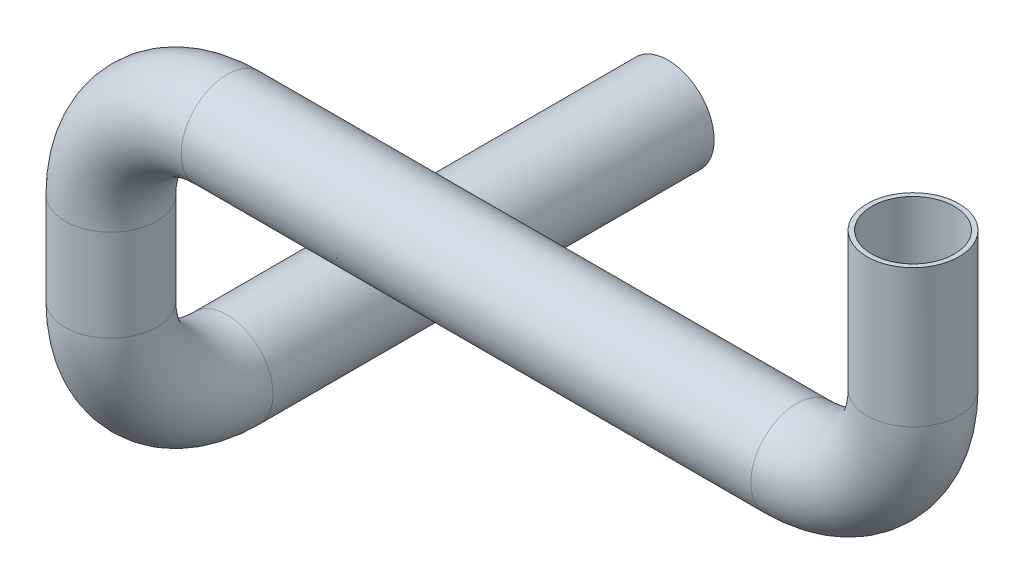
ISO-10303-21;
HEADER;
FILE_DESCRIPTION(('STEP AP214'),'2;1');
FILE_NAME('part.step','',(''),(''),'','','');
FILE_SCHEMA(('AUTOMOTIVE_DESIGN { 1 0 10303 214 1 1 1 1 }'));
ENDSEC;
DATA;
#1=APPLICATION_CONTEXT('core data for automotive mechanical design processes');
#2=APPLICATION_PROTOCOL_DEFINITION('international standard','automotive_design',2000,#1);
#3=PRODUCT_CONTEXT('',#1,'mechanical');
#4=PRODUCT('Part','Part','',(#3));
#5=PRODUCT_RELATED_PRODUCT_CATEGORY('part','',(#4));
#6=PRODUCT_DEFINITION_FORMATION('','',#4);
#7=PRODUCT_DEFINITION_CONTEXT('part definition',#1,'design');
#8=PRODUCT_DEFINITION('design','',#6,#7);
#9=PRODUCT_DEFINITION_SHAPE('','',#8);
#10=(LENGTH_UNIT() NAMED_UNIT(*) SI_UNIT(.MILLI.,.METRE.));
#11=(NAMED_UNIT(*) PLANE_ANGLE_UNIT() SI_UNIT($,.RADIAN.));
#12=(NAMED_UNIT(*) SI_UNIT($,.STERADIAN.) SOLID_ANGLE_UNIT());
#13=UNCERTAINTY_MEASURE_WITH_UNIT(LENGTH_MEASURE(1.E-05),#10,'distance_accuracy_value','');
#14=(GEOMETRIC_REPRESENTATION_CONTEXT(3) GLOBAL_UNCERTAINTY_ASSIGNED_CONTEXT((#13)) GLOBAL_UNIT_ASSIGNED_CONTEXT((#10,
#11,#12)) REPRESENTATION_CONTEXT('',''));
#15=CARTESIAN_POINT('',(0.,0.,0.));
#16=DIRECTION('',(0.,0.,1.));
#17=DIRECTION('',(1.,0.,0.));
#18=AXIS2_PLACEMENT_3D('',#15,#16,#17);
#19=CARTESIAN_POINT('',(-43.65,-12.65,0.));
#20=DIRECTION('',(0.,-1.,0.));
#21=DIRECTION('',(1.,0.,0.));
#22=AXIS2_PLACEMENT_3D('',#19,#20,#21);
#23=CYLINDRICAL_SURFACE('',#22,5.);
#24=CARTESIAN_POINT('',(-43.65,-12.65,0.));
#25=DIRECTION('',(0.,1.,0.));
#26=DIRECTION('',(0.,0.,1.));
#27=AXIS2_PLACEMENT_3D('',#24,#25,#26);
#28=CIRCLE('',#27,5.);
#29=CARTESIAN_POINT('',(-48.65,-12.65,0.));
#30=VERTEX_POINT('',#29);
#31=EDGE_CURVE('E10',#30,#30,#28,.T.);
#32=ORIENTED_EDGE('',*,*,#31,.F.);
#33=EDGE_LOOP('',(#32));
#34=FACE_BOUND('',#33,.T.);
#35=CARTESIAN_POINT('',(-43.65,-22.65,0.));
#36=DIRECTION('',(0.,-1.,0.));
#37=DIRECTION('',(0.,0.,-1.));
#38=AXIS2_PLACEMENT_3D('',#35,#36,#37);
#39=CIRCLE('',#38,5.);
#40=CARTESIAN_POINT('',(-43.65,-22.65,4.99999999999999));
#41=VERTEX_POINT('',#40);
#42=EDGE_CURVE('E59',#41,#41,#39,.T.);
#43=ORIENTED_EDGE('',*,*,#42,.F.);
#44=EDGE_LOOP('',(#43));
#45=FACE_BOUND('',#44,.T.);
#46=ADVANCED_FACE('F31',(#34,#45),#23,.T.);
#47=CARTESIAN_POINT('',(-31.,-12.65,0.));
#48=DIRECTION('',(0.,0.,1.));
#49=DIRECTION('',(1.,0.,0.));
#50=AXIS2_PLACEMENT_3D('',#47,#48,#49);
#51=TOROIDAL_SURFACE('',#50,12.65,5.);
#52=CARTESIAN_POINT('',(-31.,0.,0.));
#53=DIRECTION('',(1.,0.,0.));
#54=DIRECTION('',(0.,0.,1.));
#55=AXIS2_PLACEMENT_3D('',#52,#53,#54);
#56=CIRCLE('',#55,5.);
#57=CARTESIAN_POINT('',(-31.,4.99999999999999,0.));
#58=VERTEX_POINT('',#57);
#59=EDGE_CURVE('E37',#58,#58,#56,.T.);
#60=CARTESIAN_POINT('',(-31.,-12.65,0.));
#61=DIRECTION('',(0.,0.,1.));
#62=DIRECTION('',(1.,0.,0.));
#63=AXIS2_PLACEMENT_3D('',#60,#61,#62);
#64=CIRCLE('',#63,17.65);
#65=EDGE_CURVE('',#58,#30,#64,.T.);
#66=ORIENTED_EDGE('',*,*,#59,.F.);
#67=ORIENTED_EDGE('',*,*,#31,.T.);
#68=ORIENTED_EDGE('',*,*,#65,.T.);
#69=ORIENTED_EDGE('',*,*,#65,.F.);
#70=EDGE_LOOP('',(#66,#68,#67,#69));
#71=FACE_BOUND('',#70,.T.);
#72=ADVANCED_FACE('F105',(#71),#51,.T.);
#73=CARTESIAN_POINT('',(31.,0.,0.));
#74=DIRECTION('',(-1.,0.,0.));
#75=DIRECTION('',(0.,-1.,0.));
#76=AXIS2_PLACEMENT_3D('',#73,#74,#75);
#77=CYLINDRICAL_SURFACE('',#76,5.);
#78=CARTESIAN_POINT('',(31.,0.,0.));
#79=DIRECTION('',(1.,0.,0.));
#80=DIRECTION('',(0.,0.,1.));
#81=AXIS2_PLACEMENT_3D('',#78,#79,#80);
#82=CIRCLE('',#81,5.);
#83=CARTESIAN_POINT('',(31.,-4.99999999999999,0.));
#84=VERTEX_POINT('',#83);
#85=EDGE_CURVE('E41',#84,#84,#82,.T.);
#86=ORIENTED_EDGE('',*,*,#85,.F.);
#87=EDGE_LOOP('',(#86));
#88=FACE_BOUND('',#87,.T.);
#89=ORIENTED_EDGE('',*,*,#59,.T.);
#90=EDGE_LOOP('',(#89));
#91=FACE_BOUND('',#90,.T.);
#92=ADVANCED_FACE('F110',(#88,#91),#77,.T.);
#93=CARTESIAN_POINT('',(31.,12.65,0.));
#94=DIRECTION('',(0.,0.,-1.));
#95=DIRECTION('',(-1.,0.,0.));
#96=AXIS2_PLACEMENT_3D('',#93,#94,#95);
#97=TOROIDAL_SURFACE('',#96,12.65,5.);
#98=CARTESIAN_POINT('',(43.65,12.65,0.));
#99=DIRECTION('',(0.,1.,0.));
#100=DIRECTION('',(0.,0.,1.));
#101=AXIS2_PLACEMENT_3D('',#98,#99,#100);
#102=CIRCLE('',#101,5.);
#103=CARTESIAN_POINT('',(48.65,12.65,0.));
#104=VERTEX_POINT('',#103);
#105=EDGE_CURVE('E45',#104,#104,#102,.T.);
#106=CARTESIAN_POINT('',(31.,12.65,0.));
#107=DIRECTION('',(0.,0.,-1.));
#108=DIRECTION('',(-1.,0.,0.));
#109=AXIS2_PLACEMENT_3D('',#106,#107,#108);
#110=CIRCLE('',#109,17.65);
#111=EDGE_CURVE('',#104,#84,#110,.T.);
#112=ORIENTED_EDGE('',*,*,#105,.F.);
#113=ORIENTED_EDGE('',*,*,#85,.T.);
#114=ORIENTED_EDGE('',*,*,#111,.T.);
#115=ORIENTED_EDGE('',*,*,#111,.F.);
#116=EDGE_LOOP('',(#112,#114,#113,#115));
#117=FACE_BOUND('',#116,.T.);
#118=ADVANCED_FACE('F138',(#117),#97,.T.);
#119=CARTESIAN_POINT('',(43.65,12.65,0.));
#120=DIRECTION('',(0.,1.,0.));
#121=DIRECTION('',(0.,0.,1.));
#122=AXIS2_PLACEMENT_3D('',#119,#120,#121);
#123=CYLINDRICAL_SURFACE('',#122,5.);
#124=ORIENTED_EDGE('',*,*,#105,.T.);
#125=EDGE_LOOP('',(#124));
#126=FACE_BOUND('',#125,.T.);
#127=CARTESIAN_POINT('',(43.65,27.65,0.));
#128=DIRECTION('',(0.,1.,0.));
#129=DIRECTION('',(0.,0.,1.));
#130=AXIS2_PLACEMENT_3D('',#127,#128,#129);
#131=CIRCLE('',#130,5.);
#132=CARTESIAN_POINT('',(43.65,27.65,5.));
#133=VERTEX_POINT('',#132);
#134=EDGE_CURVE('E48',#133,#133,#131,.T.);
#135=ORIENTED_EDGE('',*,*,#134,.F.);
#136=EDGE_LOOP('',(#135));
#137=FACE_BOUND('',#136,.T.);
#138=ADVANCED_FACE('F134',(#126,#137),#123,.T.);
#139=CARTESIAN_POINT('',(43.65,27.65,0.));
#140=DIRECTION('',(0.,1.,0.));
#141=DIRECTION('',(0.,0.,1.));
#142=AXIS2_PLACEMENT_3D('',#139,#140,#141);
#143=PLANE('',#142);
#144=CARTESIAN_POINT('',(43.65,27.65,0.));
#145=DIRECTION('',(0.,1.,0.));
#146=DIRECTION('',(0.,0.,1.));
#147=AXIS2_PLACEMENT_3D('',#144,#145,#146);
#148=CIRCLE('',#147,4.5);
#149=CARTESIAN_POINT('',(43.65,27.65,4.5));
#150=VERTEX_POINT('',#149);
#151=EDGE_CURVE('E66',#150,#150,#148,.T.);
#152=ORIENTED_EDGE('',*,*,#151,.F.);
#153=EDGE_LOOP('',(#152));
#154=FACE_BOUND('',#153,.T.);
#155=ORIENTED_EDGE('',*,*,#134,.T.);
#156=EDGE_LOOP('',(#155));
#157=FACE_BOUND('',#156,.T.);
#158=ADVANCED_FACE('F126',(#154,#157),#143,.T.);
#159=CARTESIAN_POINT('',(-43.65,-35.3,-12.65));
#160=DIRECTION('',(0.,0.,-1.));
#161=DIRECTION('',(-1.,0.,0.));
#162=AXIS2_PLACEMENT_3D('',#159,#160,#161);
#163=CYLINDRICAL_SURFACE('',#162,5.);
#164=CARTESIAN_POINT('',(-43.65,-35.3,-12.65));
#165=DIRECTION('',(0.,0.,-1.));
#166=DIRECTION('',(0.,1.,0.));
#167=AXIS2_PLACEMENT_3D('',#164,#165,#166);
#168=CIRCLE('',#167,5.);
#169=CARTESIAN_POINT('',(-43.65,-40.3,-12.65));
#170=VERTEX_POINT('',#169);
#171=EDGE_CURVE('E56',#170,#170,#168,.T.);
#172=ORIENTED_EDGE('',*,*,#171,.T.);
#173=EDGE_LOOP('',(#172));
#174=FACE_BOUND('',#173,.T.);
#175=CARTESIAN_POINT('',(-43.65,-35.3,-60.65));
#176=DIRECTION('',(0.,0.,-1.));
#177=DIRECTION('',(0.,1.,0.));
#178=AXIS2_PLACEMENT_3D('',#175,#176,#177);
#179=CIRCLE('',#178,5.);
#180=CARTESIAN_POINT('',(-43.65,-30.3,-60.65));
#181=VERTEX_POINT('',#180);
#182=EDGE_CURVE('E51',#181,#181,#179,.T.);
#183=ORIENTED_EDGE('',*,*,#182,.F.);
#184=EDGE_LOOP('',(#183));
#185=FACE_BOUND('',#184,.T.);
#186=ADVANCED_FACE('F117',(#174,#185),#163,.T.);
#187=CARTESIAN_POINT('',(-43.65,-22.65,-12.65));
#188=DIRECTION('',(-1.,0.,0.));
#189=DIRECTION('',(0.,0.,1.));
#190=AXIS2_PLACEMENT_3D('',#187,#188,#189);
#191=TOROIDAL_SURFACE('',#190,12.65,5.);
#192=CARTESIAN_POINT('',(-43.65,-22.65,-12.65));
#193=DIRECTION('',(-1.,0.,0.));
#194=DIRECTION('',(0.,0.,1.));
#195=AXIS2_PLACEMENT_3D('',#192,#193,#194);
#196=CIRCLE('',#195,17.65);
#197=EDGE_CURVE('',#170,#41,#196,.T.);
#198=ORIENTED_EDGE('',*,*,#171,.F.);
#199=ORIENTED_EDGE('',*,*,#42,.T.);
#200=ORIENTED_EDGE('',*,*,#197,.T.);
#201=ORIENTED_EDGE('',*,*,#197,.F.);
#202=EDGE_LOOP('',(#198,#200,#199,#201));
#203=FACE_BOUND('',#202,.T.);
#204=ADVANCED_FACE('F115',(#203),#191,.T.);
#205=CARTESIAN_POINT('',(-43.65,-35.3,-60.65));
#206=DIRECTION('',(0.,0.,-1.));
#207=DIRECTION('',(0.,1.,0.));
#208=AXIS2_PLACEMENT_3D('',#205,#206,#207);
#209=PLANE('',#208);
#210=CARTESIAN_POINT('',(-43.65,-35.3,-60.65));
#211=DIRECTION('',(0.,0.,-1.));
#212=DIRECTION('',(0.,1.,0.));
#213=AXIS2_PLACEMENT_3D('',#210,#211,#212);
#214=CIRCLE('',#213,4.5);
#215=CARTESIAN_POINT('',(-43.65,-30.8,-60.65));
#216=VERTEX_POINT('',#215);
#217=EDGE_CURVE('E63',#216,#216,#214,.T.);
#218=ORIENTED_EDGE('',*,*,#217,.F.);
#219=EDGE_LOOP('',(#218));
#220=FACE_BOUND('',#219,.T.);
#221=ORIENTED_EDGE('',*,*,#182,.T.);
#222=EDGE_LOOP('',(#221));
#223=FACE_BOUND('',#222,.T.);
#224=ADVANCED_FACE('F102',(#220,#223),#209,.T.);
#225=CARTESIAN_POINT('',(-43.65,-12.65,0.));
#226=DIRECTION('',(0.,-1.,0.));
#227=DIRECTION('',(1.,0.,0.));
#228=AXIS2_PLACEMENT_3D('',#225,#226,#227);
#229=CYLINDRICAL_SURFACE('',#228,4.5);
#230=CARTESIAN_POINT('',(-43.65,-12.65,0.));
#231=DIRECTION('',(0.,1.,0.));
#232=DIRECTION('',(-1.,0.,0.));
#233=AXIS2_PLACEMENT_3D('',#230,#231,#232);
#234=CIRCLE('',#233,4.5);
#235=CARTESIAN_POINT('',(-48.15,-12.65,0.));
#236=VERTEX_POINT('',#235);
#237=EDGE_CURVE('E62',#236,#236,#234,.T.);
#238=ORIENTED_EDGE('',*,*,#237,.T.);
#239=EDGE_LOOP('',(#238));
#240=FACE_BOUND('',#239,.T.);
#241=CARTESIAN_POINT('',(-43.65,-22.65,0.));
#242=DIRECTION('',(0.,-1.,0.));
#243=DIRECTION('',(0.,0.,-1.));
#244=AXIS2_PLACEMENT_3D('',#241,#242,#243);
#245=CIRCLE('',#244,4.5);
#246=CARTESIAN_POINT('',(-43.65,-22.65,4.49999999999999));
#247=VERTEX_POINT('',#246);
#248=EDGE_CURVE('E73',#247,#247,#245,.T.);
#249=ORIENTED_EDGE('',*,*,#248,.T.);
#250=EDGE_LOOP('',(#249));
#251=FACE_BOUND('',#250,.T.);
#252=ADVANCED_FACE('F87',(#240,#251),#229,.F.);
#253=CARTESIAN_POINT('',(-31.,-12.65,0.));
#254=DIRECTION('',(0.,0.,1.));
#255=DIRECTION('',(1.,0.,0.));
#256=AXIS2_PLACEMENT_3D('',#253,#254,#255);
#257=TOROIDAL_SURFACE('',#256,12.65,4.5);
#258=CARTESIAN_POINT('',(-31.,0.,0.));
#259=DIRECTION('',(-1.,0.,0.));
#260=DIRECTION('',(0.,-1.,0.));
#261=AXIS2_PLACEMENT_3D('',#258,#259,#260);
#262=CIRCLE('',#261,4.5);
#263=CARTESIAN_POINT('',(-31.,4.49999999999999,0.));
#264=VERTEX_POINT('',#263);
#265=EDGE_CURVE('E79',#264,#264,#262,.F.);
#266=CARTESIAN_POINT('',(-31.,-12.65,0.));
#267=DIRECTION('',(0.,0.,1.));
#268=DIRECTION('',(1.,0.,0.));
#269=AXIS2_PLACEMENT_3D('',#266,#267,#268);
#270=CIRCLE('',#269,17.15);
#271=EDGE_CURVE('',#264,#236,#270,.T.);
#272=ORIENTED_EDGE('',*,*,#265,.T.);
#273=ORIENTED_EDGE('',*,*,#237,.F.);
#274=ORIENTED_EDGE('',*,*,#271,.T.);
#275=ORIENTED_EDGE('',*,*,#271,.F.);
#276=EDGE_LOOP('',(#272,#274,#273,#275));
#277=FACE_BOUND('',#276,.T.);
#278=ADVANCED_FACE('F90',(#277),#257,.F.);
#279=CARTESIAN_POINT('',(31.,0.,0.));
#280=DIRECTION('',(-1.,0.,0.));
#281=DIRECTION('',(0.,-1.,0.));
#282=AXIS2_PLACEMENT_3D('',#279,#280,#281);
#283=CYLINDRICAL_SURFACE('',#282,4.5);
#284=CARTESIAN_POINT('',(31.,0.,0.));
#285=DIRECTION('',(1.,0.,0.));
#286=DIRECTION('',(0.,1.,0.));
#287=AXIS2_PLACEMENT_3D('',#284,#285,#286);
#288=CIRCLE('',#287,4.5);
#289=CARTESIAN_POINT('',(31.,-4.49999999999999,0.));
#290=VERTEX_POINT('',#289);
#291=EDGE_CURVE('E76',#290,#290,#288,.T.);
#292=ORIENTED_EDGE('',*,*,#291,.T.);
#293=EDGE_LOOP('',(#292));
#294=FACE_BOUND('',#293,.T.);
#295=ORIENTED_EDGE('',*,*,#265,.F.);
#296=EDGE_LOOP('',(#295));
#297=FACE_BOUND('',#296,.T.);
#298=ADVANCED_FACE('F92',(#294,#297),#283,.F.);
#299=CARTESIAN_POINT('',(31.,12.65,0.));
#300=DIRECTION('',(0.,0.,-1.));
#301=DIRECTION('',(-1.,0.,0.));
#302=AXIS2_PLACEMENT_3D('',#299,#300,#301);
#303=TOROIDAL_SURFACE('',#302,12.65,4.5);
#304=CARTESIAN_POINT('',(43.65,12.65,0.));
#305=DIRECTION('',(0.,1.,0.));
#306=DIRECTION('',(0.,0.,1.));
#307=AXIS2_PLACEMENT_3D('',#304,#305,#306);
#308=CIRCLE('',#307,4.5);
#309=CARTESIAN_POINT('',(48.15,12.65,0.));
#310=VERTEX_POINT('',#309);
#311=EDGE_CURVE('E70',#310,#310,#308,.T.);
#312=CARTESIAN_POINT('',(31.,12.65,0.));
#313=DIRECTION('',(0.,0.,-1.));
#314=DIRECTION('',(-1.,0.,0.));
#315=AXIS2_PLACEMENT_3D('',#312,#313,#314);
#316=CIRCLE('',#315,17.15);
#317=EDGE_CURVE('',#310,#290,#316,.T.);
#318=ORIENTED_EDGE('',*,*,#311,.T.);
#319=ORIENTED_EDGE('',*,*,#291,.F.);
#320=ORIENTED_EDGE('',*,*,#317,.T.);
#321=ORIENTED_EDGE('',*,*,#317,.F.);
#322=EDGE_LOOP('',(#318,#320,#319,#321));
#323=FACE_BOUND('',#322,.T.);
#324=ADVANCED_FACE('F99',(#323),#303,.F.);
#325=CARTESIAN_POINT('',(43.65,12.65,0.));
#326=DIRECTION('',(0.,1.,0.));
#327=DIRECTION('',(0.,0.,1.));
#328=AXIS2_PLACEMENT_3D('',#325,#326,#327);
#329=CYLINDRICAL_SURFACE('',#328,4.5);
#330=ORIENTED_EDGE('',*,*,#311,.F.);
#331=EDGE_LOOP('',(#330));
#332=FACE_BOUND('',#331,.T.);
#333=ORIENTED_EDGE('',*,*,#151,.T.);
#334=EDGE_LOOP('',(#333));
#335=FACE_BOUND('',#334,.T.);
#336=ADVANCED_FACE('F200',(#332,#335),#329,.F.);
#337=CARTESIAN_POINT('',(-43.65,-35.3,-12.65));
#338=DIRECTION('',(0.,0.,-1.));
#339=DIRECTION('',(-1.,0.,0.));
#340=AXIS2_PLACEMENT_3D('',#337,#338,#339);
#341=CYLINDRICAL_SURFACE('',#340,4.5);
#342=CARTESIAN_POINT('',(-43.65,-35.3,-12.65));
#343=DIRECTION('',(0.,0.,-1.));
#344=DIRECTION('',(-1.,0.,0.));
#345=AXIS2_PLACEMENT_3D('',#342,#343,#344);
#346=CIRCLE('',#345,4.5);
#347=CARTESIAN_POINT('',(-43.65,-39.8,-12.65));
#348=VERTEX_POINT('',#347);
#349=EDGE_CURVE('E67',#348,#348,#346,.T.);
#350=ORIENTED_EDGE('',*,*,#349,.F.);
#351=EDGE_LOOP('',(#350));
#352=FACE_BOUND('',#351,.T.);
#353=ORIENTED_EDGE('',*,*,#217,.T.);
#354=EDGE_LOOP('',(#353));
#355=FACE_BOUND('',#354,.T.);
#356=ADVANCED_FACE('F209',(#352,#355),#341,.F.);
#357=CARTESIAN_POINT('',(-43.65,-22.65,-12.65));
#358=DIRECTION('',(-1.,0.,0.));
#359=DIRECTION('',(0.,0.,1.));
#360=AXIS2_PLACEMENT_3D('',#357,#358,#359);
#361=TOROIDAL_SURFACE('',#360,12.65,4.5);
#362=CARTESIAN_POINT('',(-43.65,-22.65,-12.65));
#363=DIRECTION('',(-1.,0.,0.));
#364=DIRECTION('',(0.,0.,1.));
#365=AXIS2_PLACEMENT_3D('',#362,#363,#364);
#366=CIRCLE('',#365,17.15);
#367=EDGE_CURVE('',#348,#247,#366,.T.);
#368=ORIENTED_EDGE('',*,*,#349,.T.);
#369=ORIENTED_EDGE('',*,*,#248,.F.);
#370=ORIENTED_EDGE('',*,*,#367,.T.);
#371=ORIENTED_EDGE('',*,*,#367,.F.);
#372=EDGE_LOOP('',(#368,#370,#369,#371));
#373=FACE_BOUND('',#372,.T.);
#374=ADVANCED_FACE('F218',(#373),#361,.F.);
#375=CLOSED_SHELL('',(#46,#72,#92,#118,#138,#158,#186,#204,#224,#252,#278,#298,#324,#336,#356,#374));
#376=MANIFOLD_SOLID_BREP('B2',#375);
#377=ADVANCED_BREP_SHAPE_REPRESENTATION('',(#18,#376),#14);
#378=SHAPE_DEFINITION_REPRESENTATION(#9,#377);
ENDSEC;
END-ISO-10303-21;
